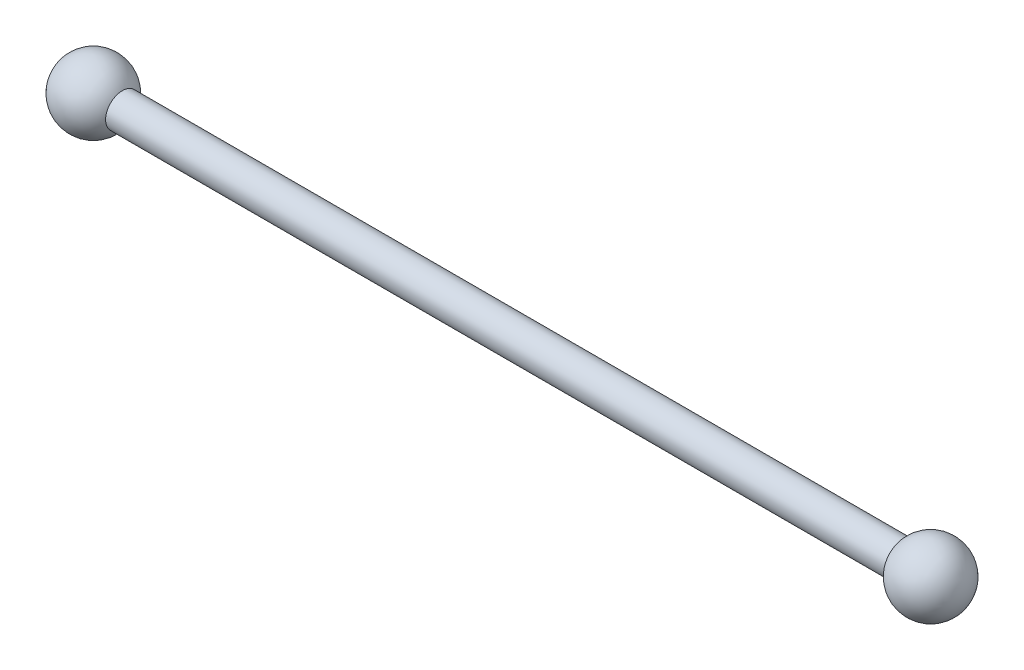
ISO-10303-21;
HEADER;
FILE_DESCRIPTION(('STEP AP214'),'2;1');
FILE_NAME('part.step','',(''),(''),'','','');
FILE_SCHEMA(('AUTOMOTIVE_DESIGN { 1 0 10303 214 1 1 1 1 }'));
ENDSEC;
DATA;
#1=APPLICATION_CONTEXT('core data for automotive mechanical design processes');
#2=APPLICATION_PROTOCOL_DEFINITION('international standard','automotive_design',2000,#1);
#3=PRODUCT_CONTEXT('',#1,'mechanical');
#4=PRODUCT('Part','Part','',(#3));
#5=PRODUCT_RELATED_PRODUCT_CATEGORY('part','',(#4));
#6=PRODUCT_DEFINITION_FORMATION('','',#4);
#7=PRODUCT_DEFINITION_CONTEXT('part definition',#1,'design');
#8=PRODUCT_DEFINITION('design','',#6,#7);
#9=PRODUCT_DEFINITION_SHAPE('','',#8);
#10=(LENGTH_UNIT() NAMED_UNIT(*) SI_UNIT(.MILLI.,.METRE.));
#11=(NAMED_UNIT(*) PLANE_ANGLE_UNIT() SI_UNIT($,.RADIAN.));
#12=(NAMED_UNIT(*) SI_UNIT($,.STERADIAN.) SOLID_ANGLE_UNIT());
#13=UNCERTAINTY_MEASURE_WITH_UNIT(LENGTH_MEASURE(1.E-05),#10,'distance_accuracy_value','');
#14=(GEOMETRIC_REPRESENTATION_CONTEXT(3) GLOBAL_UNCERTAINTY_ASSIGNED_CONTEXT((#13)) GLOBAL_UNIT_ASSIGNED_CONTEXT((#10,
#11,#12)) REPRESENTATION_CONTEXT('',''));
#15=CARTESIAN_POINT('',(0.,0.,0.));
#16=DIRECTION('',(0.,0.,1.));
#17=DIRECTION('',(1.,0.,0.));
#18=AXIS2_PLACEMENT_3D('',#15,#16,#17);
#19=CARTESIAN_POINT('',(125.,0.,0.));
#20=DIRECTION('',(-1.,0.,0.));
#21=DIRECTION('',(0.,0.,1.));
#22=AXIS2_PLACEMENT_3D('',#19,#20,#21);
#23=CYLINDRICAL_SURFACE('',#22,5.);
#24=CARTESIAN_POINT('',(116.339745962156,0.,0.));
#25=DIRECTION('',(1.,0.,0.));
#26=DIRECTION('',(0.,0.,-1.));
#27=AXIS2_PLACEMENT_3D('',#24,#25,#26);
#28=CIRCLE('',#27,5.);
#29=CARTESIAN_POINT('',(116.339745962156,0.,-5.));
#30=VERTEX_POINT('',#29);
#31=EDGE_CURVE('E38',#30,#30,#28,.T.);
#32=ORIENTED_EDGE('',*,*,#31,.F.);
#33=EDGE_LOOP('',(#32));
#34=FACE_BOUND('',#33,.T.);
#35=CARTESIAN_POINT('',(-116.339745962156,0.,0.));
#36=DIRECTION('',(-0.999999999999998,0.,0.));
#37=DIRECTION('',(0.,0.,1.));
#38=AXIS2_PLACEMENT_3D('',#35,#36,#37);
#39=CIRCLE('',#38,5.);
#40=CARTESIAN_POINT('',(-116.339745962156,0.,5.));
#41=VERTEX_POINT('',#40);
#42=EDGE_CURVE('E10',#41,#41,#39,.T.);
#43=ORIENTED_EDGE('',*,*,#42,.F.);
#44=EDGE_LOOP('',(#43));
#45=FACE_BOUND('',#44,.T.);
#46=ADVANCED_FACE('F32',(#34,#45),#23,.T.);
#47=CARTESIAN_POINT('',(125.,0.,0.));
#48=DIRECTION('',(0.,1.,0.));
#49=DIRECTION('',(0.,0.,-1.));
#50=AXIS2_PLACEMENT_3D('',#47,#48,#49);
#51=SPHERICAL_SURFACE('',#50,10.);
#52=CARTESIAN_POINT('',(125.,0.,0.));
#53=DIRECTION('',(1.,0.,0.));
#54=DIRECTION('',(0.,0.,-1.));
#55=AXIS2_PLACEMENT_3D('',#52,#53,#54);
#56=SPHERICAL_SURFACE('',#55,10.);
#57=ORIENTED_EDGE('',*,*,#31,.T.);
#58=EDGE_LOOP('',(#57));
#59=FACE_BOUND('',#58,.T.);
#60=ADVANCED_FACE('F44',(#59),#56,.T.);
#61=CARTESIAN_POINT('',(-125.,0.,0.));
#62=DIRECTION('',(0.,1.,0.));
#63=DIRECTION('',(0.,0.,-1.));
#64=AXIS2_PLACEMENT_3D('',#61,#62,#63);
#65=SPHERICAL_SURFACE('',#64,10.);
#66=CARTESIAN_POINT('',(-125.,0.,0.));
#67=DIRECTION('',(-1.,0.,0.));
#68=DIRECTION('',(0.,0.,1.));
#69=AXIS2_PLACEMENT_3D('',#66,#67,#68);
#70=SPHERICAL_SURFACE('',#69,10.);
#71=ORIENTED_EDGE('',*,*,#42,.T.);
#72=EDGE_LOOP('',(#71));
#73=FACE_BOUND('',#72,.T.);
#74=ADVANCED_FACE('F51',(#73),#70,.T.);
#75=CLOSED_SHELL('',(#46,#60,#74));
#76=MANIFOLD_SOLID_BREP('B2',#75);
#77=ADVANCED_BREP_SHAPE_REPRESENTATION('',(#18,#76),#14);
#78=SHAPE_DEFINITION_REPRESENTATION(#9,#77);
ENDSEC;
END-ISO-10303-21;
